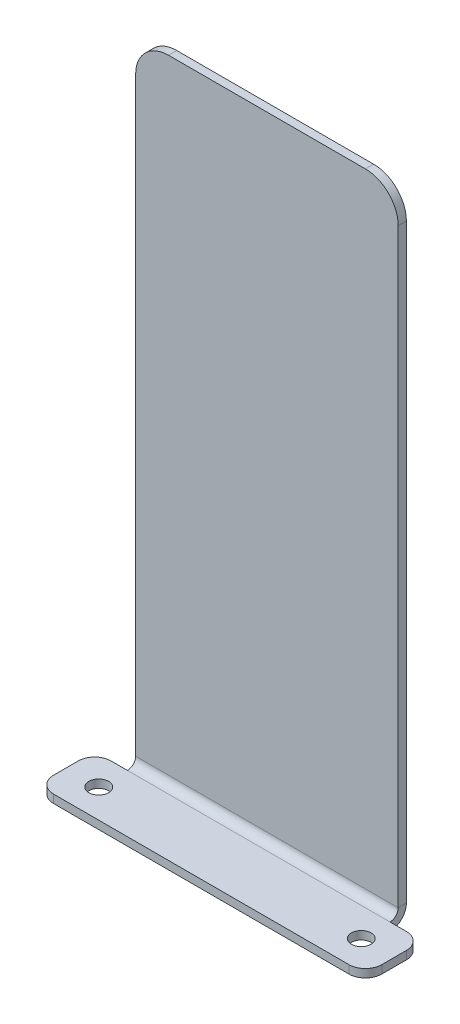
ISO-10303-21;
HEADER;
FILE_DESCRIPTION(('STEP AP214'),'2;1');
FILE_NAME('part.step','',(''),(''),'','','');
FILE_SCHEMA(('AUTOMOTIVE_DESIGN { 1 0 10303 214 1 1 1 1 }'));
ENDSEC;
DATA;
#1=APPLICATION_CONTEXT('core data for automotive mechanical design processes');
#2=APPLICATION_PROTOCOL_DEFINITION('international standard','automotive_design',2000,#1);
#3=PRODUCT_CONTEXT('',#1,'mechanical');
#4=PRODUCT('Part','Part','',(#3));
#5=PRODUCT_RELATED_PRODUCT_CATEGORY('part','',(#4));
#6=PRODUCT_DEFINITION_FORMATION('','',#4);
#7=PRODUCT_DEFINITION_CONTEXT('part definition',#1,'design');
#8=PRODUCT_DEFINITION('design','',#6,#7);
#9=PRODUCT_DEFINITION_SHAPE('','',#8);
#10=(LENGTH_UNIT() NAMED_UNIT(*) SI_UNIT(.MILLI.,.METRE.));
#11=(NAMED_UNIT(*) PLANE_ANGLE_UNIT() SI_UNIT($,.RADIAN.));
#12=(NAMED_UNIT(*) SI_UNIT($,.STERADIAN.) SOLID_ANGLE_UNIT());
#13=UNCERTAINTY_MEASURE_WITH_UNIT(LENGTH_MEASURE(1.E-05),#10,'distance_accuracy_value','');
#14=(GEOMETRIC_REPRESENTATION_CONTEXT(3) GLOBAL_UNCERTAINTY_ASSIGNED_CONTEXT((#13)) GLOBAL_UNIT_ASSIGNED_CONTEXT((#10,
#11,#12)) REPRESENTATION_CONTEXT('',''));
#15=CARTESIAN_POINT('',(0.,0.,0.));
#16=DIRECTION('',(0.,0.,1.));
#17=DIRECTION('',(1.,0.,0.));
#18=AXIS2_PLACEMENT_3D('',#15,#16,#17);
#19=CARTESIAN_POINT('',(50.8,0.,-3.175));
#20=DIRECTION('',(1.,0.,0.));
#21=DIRECTION('',(0.,1.,0.));
#22=AXIS2_PLACEMENT_3D('',#19,#20,#21);
#23=PLANE('',#22);
#24=DIRECTION('',(0.,1.,0.));
#25=VECTOR('',#24,1.);
#26=CARTESIAN_POINT('',(50.8,0.,-3.175));
#27=LINE('',#26,#25);
#28=CARTESIAN_POINT('',(50.8,6.34999999999999,-3.175));
#29=VERTEX_POINT('',#28);
#30=CARTESIAN_POINT('',(50.8,234.95,-3.175));
#31=VERTEX_POINT('',#30);
#32=EDGE_CURVE('E236',#29,#31,#27,.T.);
#33=ORIENTED_EDGE('',*,*,#32,.T.);
#34=DIRECTION('',(0.,0.,1.));
#35=VECTOR('',#34,1.);
#36=CARTESIAN_POINT('',(50.8,234.95,-3.175));
#37=LINE('',#36,#35);
#38=CARTESIAN_POINT('',(50.8,234.95,0.));
#39=VERTEX_POINT('',#38);
#40=EDGE_CURVE('E264',#31,#39,#37,.T.);
#41=ORIENTED_EDGE('',*,*,#40,.T.);
#42=DIRECTION('',(0.,1.,0.));
#43=VECTOR('',#42,1.);
#44=CARTESIAN_POINT('',(50.8,0.,0.));
#45=LINE('',#44,#43);
#46=CARTESIAN_POINT('',(50.8,6.35,0.));
#47=VERTEX_POINT('',#46);
#48=EDGE_CURVE('E245',#47,#39,#45,.T.);
#49=ORIENTED_EDGE('',*,*,#48,.F.);
#50=DIRECTION('',(0.,0.,-1.));
#51=VECTOR('',#50,1.);
#52=CARTESIAN_POINT('',(50.8,6.35,0.));
#53=LINE('',#52,#51);
#54=EDGE_CURVE('E221',#47,#29,#53,.T.);
#55=ORIENTED_EDGE('',*,*,#54,.T.);
#56=EDGE_LOOP('',(#33,#41,#49,#55));
#57=FACE_BOUND('',#56,.T.);
#58=ADVANCED_FACE('F58',(#57),#23,.T.);
#59=CARTESIAN_POINT('',(0.,0.,-3.175));
#60=DIRECTION('',(0.,0.,-1.));
#61=DIRECTION('',(-1.,0.,0.));
#62=AXIS2_PLACEMENT_3D('',#59,#60,#61);
#63=PLANE('',#62);
#64=DIRECTION('',(0.,-1.,0.));
#65=VECTOR('',#64,1.);
#66=CARTESIAN_POINT('',(-50.8,0.,-3.175));
#67=LINE('',#66,#65);
#68=CARTESIAN_POINT('',(-50.8000000000001,234.95,-3.175));
#69=VERTEX_POINT('',#68);
#70=CARTESIAN_POINT('',(-50.8,6.34999999999999,-3.175));
#71=VERTEX_POINT('',#70);
#72=EDGE_CURVE('E234',#69,#71,#67,.T.);
#73=ORIENTED_EDGE('',*,*,#72,.F.);
#74=CARTESIAN_POINT('',(-38.1000000000001,234.95,-3.175));
#75=DIRECTION('',(0.,0.,-1.));
#76=DIRECTION('',(-1.,0.,0.));
#77=AXIS2_PLACEMENT_3D('',#74,#75,#76);
#78=CIRCLE('',#77,12.7);
#79=CARTESIAN_POINT('',(-38.1000000000001,247.65,-3.175));
#80=VERTEX_POINT('',#79);
#81=EDGE_CURVE('E262',#69,#80,#78,.T.);
#82=ORIENTED_EDGE('',*,*,#81,.T.);
#83=DIRECTION('',(-1.,0.,0.));
#84=VECTOR('',#83,1.);
#85=CARTESIAN_POINT('',(-50.8000000000001,247.65,-3.175));
#86=LINE('',#85,#84);
#87=CARTESIAN_POINT('',(38.1,247.65,-3.175));
#88=VERTEX_POINT('',#87);
#89=EDGE_CURVE('E240',#88,#80,#86,.T.);
#90=ORIENTED_EDGE('',*,*,#89,.F.);
#91=CARTESIAN_POINT('',(38.1,234.95,-3.175));
#92=DIRECTION('',(0.,0.,-1.));
#93=DIRECTION('',(-1.,0.,0.));
#94=AXIS2_PLACEMENT_3D('',#91,#92,#93);
#95=CIRCLE('',#94,12.7);
#96=EDGE_CURVE('E260',#88,#31,#95,.T.);
#97=ORIENTED_EDGE('',*,*,#96,.T.);
#98=ORIENTED_EDGE('',*,*,#32,.F.);
#99=DIRECTION('',(1.,0.,0.));
#100=VECTOR('',#99,1.);
#101=CARTESIAN_POINT('',(50.8,6.34999999999999,-3.175));
#102=LINE('',#101,#100);
#103=EDGE_CURVE('E194',#29,#71,#102,.F.);
#104=ORIENTED_EDGE('',*,*,#103,.T.);
#105=EDGE_LOOP('',(#73,#82,#90,#97,#98,#104));
#106=FACE_BOUND('',#105,.T.);
#107=ADVANCED_FACE('F372',(#106),#63,.T.);
#108=CARTESIAN_POINT('',(0.,0.,0.));
#109=DIRECTION('',(0.,0.,-1.));
#110=DIRECTION('',(-1.,0.,0.));
#111=AXIS2_PLACEMENT_3D('',#108,#109,#110);
#112=PLANE('',#111);
#113=DIRECTION('',(-1.,0.,0.));
#114=VECTOR('',#113,1.);
#115=CARTESIAN_POINT('',(-50.8000000000001,247.65,0.));
#116=LINE('',#115,#114);
#117=CARTESIAN_POINT('',(38.1,247.65,0.));
#118=VERTEX_POINT('',#117);
#119=CARTESIAN_POINT('',(-38.1000000000001,247.65,0.));
#120=VERTEX_POINT('',#119);
#121=EDGE_CURVE('E237',#118,#120,#116,.T.);
#122=ORIENTED_EDGE('',*,*,#121,.T.);
#123=CARTESIAN_POINT('',(-38.1000000000001,234.95,0.));
#124=DIRECTION('',(0.,0.,-1.));
#125=DIRECTION('',(-1.,0.,0.));
#126=AXIS2_PLACEMENT_3D('',#123,#124,#125);
#127=CIRCLE('',#126,12.7);
#128=CARTESIAN_POINT('',(-50.8000000000001,234.95,0.));
#129=VERTEX_POINT('',#128);
#130=EDGE_CURVE('E256',#120,#129,#127,.F.);
#131=ORIENTED_EDGE('',*,*,#130,.T.);
#132=DIRECTION('',(0.,-1.,0.));
#133=VECTOR('',#132,1.);
#134=CARTESIAN_POINT('',(-50.8,0.,0.));
#135=LINE('',#134,#133);
#136=CARTESIAN_POINT('',(-50.8,6.34999999999997,0.));
#137=VERTEX_POINT('',#136);
#138=EDGE_CURVE('E232',#129,#137,#135,.T.);
#139=ORIENTED_EDGE('',*,*,#138,.T.);
#140=DIRECTION('',(1.,0.,0.));
#141=VECTOR('',#140,1.);
#142=CARTESIAN_POINT('',(50.8,6.35,0.));
#143=LINE('',#142,#141);
#144=EDGE_CURVE('E225',#47,#137,#143,.F.);
#145=ORIENTED_EDGE('',*,*,#144,.F.);
#146=ORIENTED_EDGE('',*,*,#48,.T.);
#147=CARTESIAN_POINT('',(38.1,234.95,0.));
#148=DIRECTION('',(0.,0.,-1.));
#149=DIRECTION('',(-1.,0.,0.));
#150=AXIS2_PLACEMENT_3D('',#147,#148,#149);
#151=CIRCLE('',#150,12.7);
#152=EDGE_CURVE('E254',#39,#118,#151,.F.);
#153=ORIENTED_EDGE('',*,*,#152,.T.);
#154=EDGE_LOOP('',(#122,#131,#139,#145,#146,#153));
#155=FACE_BOUND('',#154,.T.);
#156=ADVANCED_FACE('F378',(#155),#112,.F.);
#157=CARTESIAN_POINT('',(-50.8,0.,-3.175));
#158=DIRECTION('',(-1.,0.,0.));
#159=DIRECTION('',(0.,-1.,0.));
#160=AXIS2_PLACEMENT_3D('',#157,#158,#159);
#161=PLANE('',#160);
#162=ORIENTED_EDGE('',*,*,#138,.F.);
#163=DIRECTION('',(0.,0.,1.));
#164=VECTOR('',#163,1.);
#165=CARTESIAN_POINT('',(-50.8000000000001,234.95,-3.175));
#166=LINE('',#165,#164);
#167=EDGE_CURVE('E258',#129,#69,#166,.F.);
#168=ORIENTED_EDGE('',*,*,#167,.T.);
#169=ORIENTED_EDGE('',*,*,#72,.T.);
#170=DIRECTION('',(0.,0.,-1.));
#171=VECTOR('',#170,1.);
#172=CARTESIAN_POINT('',(-50.8,6.34999999999997,0.));
#173=LINE('',#172,#171);
#174=EDGE_CURVE('E229',#137,#71,#173,.T.);
#175=ORIENTED_EDGE('',*,*,#174,.F.);
#176=EDGE_LOOP('',(#162,#168,#169,#175));
#177=FACE_BOUND('',#176,.T.);
#178=ADVANCED_FACE('F385',(#177),#161,.T.);
#179=CARTESIAN_POINT('',(-50.8000000000001,247.65,-3.175));
#180=DIRECTION('',(0.,1.,0.));
#181=DIRECTION('',(-1.,0.,0.));
#182=AXIS2_PLACEMENT_3D('',#179,#180,#181);
#183=PLANE('',#182);
#184=ORIENTED_EDGE('',*,*,#89,.T.);
#185=DIRECTION('',(0.,0.,1.));
#186=VECTOR('',#185,1.);
#187=CARTESIAN_POINT('',(-38.1000000000001,247.65,-3.175));
#188=LINE('',#187,#186);
#189=EDGE_CURVE('E251',#80,#120,#188,.T.);
#190=ORIENTED_EDGE('',*,*,#189,.T.);
#191=ORIENTED_EDGE('',*,*,#121,.F.);
#192=DIRECTION('',(0.,0.,1.));
#193=VECTOR('',#192,1.);
#194=CARTESIAN_POINT('',(38.1,247.65,-3.175));
#195=LINE('',#194,#193);
#196=EDGE_CURVE('E243',#118,#88,#195,.F.);
#197=ORIENTED_EDGE('',*,*,#196,.T.);
#198=EDGE_LOOP('',(#184,#190,#191,#197));
#199=FACE_BOUND('',#198,.T.);
#200=ADVANCED_FACE('F383',(#199),#183,.T.);
#201=CARTESIAN_POINT('',(-50.8,6.34999999999997,3.175));
#202=DIRECTION('',(-1.,0.,0.));
#203=DIRECTION('',(0.,-1.,0.));
#204=AXIS2_PLACEMENT_3D('',#201,#202,#203);
#205=PLANE('',#204);
#206=DIRECTION('',(0.,1.,0.));
#207=VECTOR('',#206,1.);
#208=CARTESIAN_POINT('',(-50.8,0.,3.17499999999998));
#209=LINE('',#208,#207);
#210=CARTESIAN_POINT('',(-50.8,3.17499999999998,3.17499999999999));
#211=VERTEX_POINT('',#210);
#212=CARTESIAN_POINT('',(-50.8,0.,3.17499999999998));
#213=VERTEX_POINT('',#212);
#214=EDGE_CURVE('E216',#211,#213,#209,.F.);
#215=ORIENTED_EDGE('',*,*,#214,.F.);
#216=CARTESIAN_POINT('',(-50.8,6.34999999999997,3.175));
#217=DIRECTION('',(1.,0.,0.));
#218=DIRECTION('',(0.,1.,0.));
#219=AXIS2_PLACEMENT_3D('',#216,#217,#218);
#220=CIRCLE('',#219,3.175);
#221=EDGE_CURVE('E197',#137,#211,#220,.F.);
#222=ORIENTED_EDGE('',*,*,#221,.F.);
#223=ORIENTED_EDGE('',*,*,#174,.T.);
#224=CARTESIAN_POINT('',(-50.8,6.34999999999997,3.175));
#225=DIRECTION('',(1.,0.,0.));
#226=DIRECTION('',(0.,1.,0.));
#227=AXIS2_PLACEMENT_3D('',#224,#225,#226);
#228=CIRCLE('',#227,6.35);
#229=EDGE_CURVE('E220',#71,#213,#228,.F.);
#230=ORIENTED_EDGE('',*,*,#229,.T.);
#231=EDGE_LOOP('',(#215,#222,#223,#230));
#232=FACE_BOUND('',#231,.T.);
#233=ADVANCED_FACE('F418',(#232),#205,.T.);
#234=CARTESIAN_POINT('',(50.8,6.35,3.17499999999999));
#235=DIRECTION('',(-1.,0.,0.));
#236=DIRECTION('',(0.,-1.,0.));
#237=AXIS2_PLACEMENT_3D('',#234,#235,#236);
#238=PLANE('',#237);
#239=CARTESIAN_POINT('',(50.8,6.35,3.17499999999999));
#240=DIRECTION('',(1.,0.,0.));
#241=DIRECTION('',(0.,1.,0.));
#242=AXIS2_PLACEMENT_3D('',#239,#240,#241);
#243=CIRCLE('',#242,3.175);
#244=CARTESIAN_POINT('',(50.8,3.175,3.17499999999999));
#245=VERTEX_POINT('',#244);
#246=EDGE_CURVE('E202',#245,#47,#243,.T.);
#247=ORIENTED_EDGE('',*,*,#246,.F.);
#248=DIRECTION('',(0.,1.,0.));
#249=VECTOR('',#248,1.);
#250=CARTESIAN_POINT('',(50.8,3.175,3.17499999999999));
#251=LINE('',#250,#249);
#252=CARTESIAN_POINT('',(50.8,0.,3.17499999999998));
#253=VERTEX_POINT('',#252);
#254=EDGE_CURVE('E177',#245,#253,#251,.F.);
#255=ORIENTED_EDGE('',*,*,#254,.T.);
#256=CARTESIAN_POINT('',(50.8,6.35,3.17499999999999));
#257=DIRECTION('',(1.,0.,0.));
#258=DIRECTION('',(0.,1.,0.));
#259=AXIS2_PLACEMENT_3D('',#256,#257,#258);
#260=CIRCLE('',#259,6.35);
#261=EDGE_CURVE('E188',#253,#29,#260,.T.);
#262=ORIENTED_EDGE('',*,*,#261,.T.);
#263=ORIENTED_EDGE('',*,*,#54,.F.);
#264=EDGE_LOOP('',(#247,#255,#262,#263));
#265=FACE_BOUND('',#264,.T.);
#266=ADVANCED_FACE('F200',(#265),#238,.F.);
#267=CARTESIAN_POINT('',(50.8,6.35,3.17499999999999));
#268=DIRECTION('',(1.,0.,0.));
#269=DIRECTION('',(0.,-1.,0.));
#270=AXIS2_PLACEMENT_3D('',#267,#268,#269);
#271=CYLINDRICAL_SURFACE('',#270,6.35);
#272=ORIENTED_EDGE('',*,*,#103,.F.);
#273=ORIENTED_EDGE('',*,*,#261,.F.);
#274=DIRECTION('',(1.,0.,0.));
#275=VECTOR('',#274,1.);
#276=CARTESIAN_POINT('',(-50.8,0.,3.17499999999998));
#277=LINE('',#276,#275);
#278=EDGE_CURVE('E191',#253,#213,#277,.F.);
#279=ORIENTED_EDGE('',*,*,#278,.T.);
#280=ORIENTED_EDGE('',*,*,#229,.F.);
#281=EDGE_LOOP('',(#272,#273,#279,#280));
#282=FACE_BOUND('',#281,.T.);
#283=ADVANCED_FACE('F189',(#282),#271,.T.);
#284=CARTESIAN_POINT('',(50.8,6.35,3.17499999999999));
#285=DIRECTION('',(1.,0.,0.));
#286=DIRECTION('',(0.,-1.,0.));
#287=AXIS2_PLACEMENT_3D('',#284,#285,#286);
#288=CYLINDRICAL_SURFACE('',#287,3.175);
#289=ORIENTED_EDGE('',*,*,#144,.T.);
#290=ORIENTED_EDGE('',*,*,#221,.T.);
#291=DIRECTION('',(1.,0.,0.));
#292=VECTOR('',#291,1.);
#293=CARTESIAN_POINT('',(-50.8,3.17499999999998,3.17499999999999));
#294=LINE('',#293,#292);
#295=EDGE_CURVE('E203',#211,#245,#294,.T.);
#296=ORIENTED_EDGE('',*,*,#295,.T.);
#297=ORIENTED_EDGE('',*,*,#246,.T.);
#298=EDGE_LOOP('',(#289,#290,#296,#297));
#299=FACE_BOUND('',#298,.T.);
#300=ADVANCED_FACE('F414',(#299),#288,.F.);
#301=CARTESIAN_POINT('',(0.,0.,0.));
#302=DIRECTION('',(0.,1.,0.));
#303=DIRECTION('',(0.,0.,1.));
#304=AXIS2_PLACEMENT_3D('',#301,#302,#303);
#305=PLANE('',#304);
#306=CARTESIAN_POINT('',(-50.8,-2.78423117894278E-13,14.2875));
#307=DIRECTION('',(0.,1.,0.));
#308=DIRECTION('',(0.,0.,1.));
#309=AXIS2_PLACEMENT_3D('',#306,#307,#308);
#310=CIRCLE('',#309,3.81);
#311=CARTESIAN_POINT('',(-50.8,-2.9172566179527E-13,18.0975));
#312=VERTEX_POINT('',#311);
#313=EDGE_CURVE('E343',#312,#312,#310,.T.);
#314=ORIENTED_EDGE('',*,*,#313,.T.);
#315=EDGE_LOOP('',(#314));
#316=FACE_BOUND('',#315,.T.);
#317=CARTESIAN_POINT('',(50.8,-2.59774840527527E-13,14.2875));
#318=DIRECTION('',(0.,1.,0.));
#319=DIRECTION('',(0.,0.,1.));
#320=AXIS2_PLACEMENT_3D('',#317,#318,#319);
#321=CIRCLE('',#320,3.81);
#322=CARTESIAN_POINT('',(50.8,-2.73077384428519E-13,18.0975));
#323=VERTEX_POINT('',#322);
#324=EDGE_CURVE('E315',#323,#323,#321,.T.);
#325=ORIENTED_EDGE('',*,*,#324,.T.);
#326=EDGE_LOOP('',(#325));
#327=FACE_BOUND('',#326,.T.);
#328=DIRECTION('',(0.,0.,-1.));
#329=VECTOR('',#328,1.);
#330=CARTESIAN_POINT('',(-63.5,0.,25.4));
#331=LINE('',#330,#329);
#332=CARTESIAN_POINT('',(-63.5,0.,19.05));
#333=VERTEX_POINT('',#332);
#334=CARTESIAN_POINT('',(-63.5,0.,9.52499999999998));
#335=VERTEX_POINT('',#334);
#336=EDGE_CURVE('E218',#333,#335,#331,.T.);
#337=ORIENTED_EDGE('',*,*,#336,.T.);
#338=CARTESIAN_POINT('',(-57.15,0.,9.52499999999998));
#339=DIRECTION('',(0.,1.,0.));
#340=DIRECTION('',(0.,0.,1.));
#341=AXIS2_PLACEMENT_3D('',#338,#339,#340);
#342=CIRCLE('',#341,6.35);
#343=CARTESIAN_POINT('',(-57.15,0.,3.17499999999998));
#344=VERTEX_POINT('',#343);
#345=EDGE_CURVE('E288',#335,#344,#342,.F.);
#346=ORIENTED_EDGE('',*,*,#345,.T.);
#347=DIRECTION('',(1.,0.,0.));
#348=VECTOR('',#347,1.);
#349=CARTESIAN_POINT('',(-63.5,0.,3.17499999999998));
#350=LINE('',#349,#348);
#351=EDGE_CURVE('E182',#344,#213,#350,.T.);
#352=ORIENTED_EDGE('',*,*,#351,.T.);
#353=ORIENTED_EDGE('',*,*,#278,.F.);
#354=CARTESIAN_POINT('',(57.15,0.,3.17499999999998));
#355=VERTEX_POINT('',#354);
#356=EDGE_CURVE('E172',#253,#355,#350,.T.);
#357=ORIENTED_EDGE('',*,*,#356,.T.);
#358=CARTESIAN_POINT('',(57.15,0.,9.52499999999998));
#359=DIRECTION('',(0.,1.,0.));
#360=DIRECTION('',(0.,0.,1.));
#361=AXIS2_PLACEMENT_3D('',#358,#359,#360);
#362=CIRCLE('',#361,6.35);
#363=CARTESIAN_POINT('',(63.5,0.,9.52499999999998));
#364=VERTEX_POINT('',#363);
#365=EDGE_CURVE('E284',#355,#364,#362,.F.);
#366=ORIENTED_EDGE('',*,*,#365,.T.);
#367=DIRECTION('',(0.,0.,1.));
#368=VECTOR('',#367,1.);
#369=CARTESIAN_POINT('',(63.5,0.,25.4));
#370=LINE('',#369,#368);
#371=CARTESIAN_POINT('',(63.5,0.,19.05));
#372=VERTEX_POINT('',#371);
#373=EDGE_CURVE('E183',#364,#372,#370,.T.);
#374=ORIENTED_EDGE('',*,*,#373,.T.);
#375=CARTESIAN_POINT('',(57.15,0.,19.05));
#376=DIRECTION('',(0.,1.,0.));
#377=DIRECTION('',(0.,0.,1.));
#378=AXIS2_PLACEMENT_3D('',#375,#376,#377);
#379=CIRCLE('',#378,6.35);
#380=CARTESIAN_POINT('',(57.15,0.,25.4));
#381=VERTEX_POINT('',#380);
#382=EDGE_CURVE('E80',#372,#381,#379,.F.);
#383=ORIENTED_EDGE('',*,*,#382,.T.);
#384=DIRECTION('',(-1.,0.,0.));
#385=VECTOR('',#384,1.);
#386=CARTESIAN_POINT('',(0.,0.,25.4));
#387=LINE('',#386,#385);
#388=CARTESIAN_POINT('',(-57.15,0.,25.4));
#389=VERTEX_POINT('',#388);
#390=EDGE_CURVE('E211',#381,#389,#387,.T.);
#391=ORIENTED_EDGE('',*,*,#390,.T.);
#392=CARTESIAN_POINT('',(-57.15,0.,19.05));
#393=DIRECTION('',(0.,1.,0.));
#394=DIRECTION('',(0.,0.,1.));
#395=AXIS2_PLACEMENT_3D('',#392,#393,#394);
#396=CIRCLE('',#395,6.35);
#397=EDGE_CURVE('E286',#389,#333,#396,.F.);
#398=ORIENTED_EDGE('',*,*,#397,.T.);
#399=EDGE_LOOP('',(#337,#346,#352,#353,#357,#366,#374,#383,#391,#398));
#400=FACE_BOUND('',#399,.T.);
#401=ADVANCED_FACE('F206',(#316,#327,#400),#305,.F.);
#402=CARTESIAN_POINT('',(0.,3.175,0.));
#403=DIRECTION('',(0.,1.,0.));
#404=DIRECTION('',(0.,0.,1.));
#405=AXIS2_PLACEMENT_3D('',#402,#403,#404);
#406=PLANE('',#405);
#407=CARTESIAN_POINT('',(-50.8,3.17499999999994,14.2875));
#408=DIRECTION('',(0.,1.,0.));
#409=DIRECTION('',(0.,0.,1.));
#410=AXIS2_PLACEMENT_3D('',#407,#408,#409);
#411=CIRCLE('',#410,3.81);
#412=CARTESIAN_POINT('',(-50.8,3.17499999999993,18.0975));
#413=VERTEX_POINT('',#412);
#414=EDGE_CURVE('E346',#413,#413,#411,.T.);
#415=ORIENTED_EDGE('',*,*,#414,.F.);
#416=EDGE_LOOP('',(#415));
#417=FACE_BOUND('',#416,.T.);
#418=CARTESIAN_POINT('',(50.8,3.17499999999996,14.2875));
#419=DIRECTION('',(0.,1.,0.));
#420=DIRECTION('',(0.,0.,1.));
#421=AXIS2_PLACEMENT_3D('',#418,#419,#420);
#422=CIRCLE('',#421,3.81);
#423=CARTESIAN_POINT('',(50.8,3.17499999999995,18.0975));
#424=VERTEX_POINT('',#423);
#425=EDGE_CURVE('E340',#424,#424,#422,.T.);
#426=ORIENTED_EDGE('',*,*,#425,.F.);
#427=EDGE_LOOP('',(#426));
#428=FACE_BOUND('',#427,.T.);
#429=DIRECTION('',(-1.,0.,0.));
#430=VECTOR('',#429,1.);
#431=CARTESIAN_POINT('',(-63.5,3.17499999999998,3.17499999999999));
#432=LINE('',#431,#430);
#433=CARTESIAN_POINT('',(-57.15,3.17499999999998,3.17499999999999));
#434=VERTEX_POINT('',#433);
#435=EDGE_CURVE('E309',#211,#434,#432,.T.);
#436=ORIENTED_EDGE('',*,*,#435,.T.);
#437=CARTESIAN_POINT('',(-57.15,3.17499999999998,9.52499999999999));
#438=DIRECTION('',(0.,1.,0.));
#439=DIRECTION('',(0.,0.,1.));
#440=AXIS2_PLACEMENT_3D('',#437,#438,#439);
#441=CIRCLE('',#440,6.35);
#442=CARTESIAN_POINT('',(-63.5,3.17499999999996,9.525));
#443=VERTEX_POINT('',#442);
#444=EDGE_CURVE('E276',#434,#443,#441,.T.);
#445=ORIENTED_EDGE('',*,*,#444,.T.);
#446=DIRECTION('',(0.,0.,1.));
#447=VECTOR('',#446,1.);
#448=CARTESIAN_POINT('',(-63.5,3.1749999999999,25.4));
#449=LINE('',#448,#447);
#450=CARTESIAN_POINT('',(-63.5,3.17499999999992,19.05));
#451=VERTEX_POINT('',#450);
#452=EDGE_CURVE('E310',#443,#451,#449,.T.);
#453=ORIENTED_EDGE('',*,*,#452,.T.);
#454=CARTESIAN_POINT('',(-57.15,3.17499999999996,19.05));
#455=DIRECTION('',(0.,1.,0.));
#456=DIRECTION('',(0.,0.,1.));
#457=AXIS2_PLACEMENT_3D('',#454,#455,#456);
#458=CIRCLE('',#457,6.35);
#459=CARTESIAN_POINT('',(-57.15,3.1749999999999,25.4));
#460=VERTEX_POINT('',#459);
#461=EDGE_CURVE('E274',#451,#460,#458,.T.);
#462=ORIENTED_EDGE('',*,*,#461,.T.);
#463=DIRECTION('',(1.,0.,0.));
#464=VECTOR('',#463,1.);
#465=CARTESIAN_POINT('',(-50.8,3.1749999999999,25.4));
#466=LINE('',#465,#464);
#467=CARTESIAN_POINT('',(57.15,3.17499999999992,25.4));
#468=VERTEX_POINT('',#467);
#469=EDGE_CURVE('E209',#468,#460,#466,.F.);
#470=ORIENTED_EDGE('',*,*,#469,.F.);
#471=CARTESIAN_POINT('',(57.15,3.17499999999994,19.05));
#472=DIRECTION('',(0.,1.,0.));
#473=DIRECTION('',(0.,0.,1.));
#474=AXIS2_PLACEMENT_3D('',#471,#472,#473);
#475=CIRCLE('',#474,6.35);
#476=CARTESIAN_POINT('',(63.5,3.17499999999994,19.05));
#477=VERTEX_POINT('',#476);
#478=EDGE_CURVE('E270',#468,#477,#475,.T.);
#479=ORIENTED_EDGE('',*,*,#478,.T.);
#480=DIRECTION('',(0.,0.,-1.));
#481=VECTOR('',#480,1.);
#482=CARTESIAN_POINT('',(63.5,3.17499999999992,25.4));
#483=LINE('',#482,#481);
#484=CARTESIAN_POINT('',(63.5,3.17499999999998,9.525));
#485=VERTEX_POINT('',#484);
#486=EDGE_CURVE('E302',#477,#485,#483,.T.);
#487=ORIENTED_EDGE('',*,*,#486,.T.);
#488=CARTESIAN_POINT('',(57.15,3.17499999999998,9.52499999999999));
#489=DIRECTION('',(0.,1.,0.));
#490=DIRECTION('',(0.,0.,1.));
#491=AXIS2_PLACEMENT_3D('',#488,#489,#490);
#492=CIRCLE('',#491,6.35);
#493=CARTESIAN_POINT('',(57.15,3.175,3.17499999999999));
#494=VERTEX_POINT('',#493);
#495=EDGE_CURVE('E272',#485,#494,#492,.T.);
#496=ORIENTED_EDGE('',*,*,#495,.T.);
#497=EDGE_CURVE('E312',#494,#245,#432,.T.);
#498=ORIENTED_EDGE('',*,*,#497,.T.);
#499=ORIENTED_EDGE('',*,*,#295,.F.);
#500=EDGE_LOOP('',(#436,#445,#453,#462,#470,#479,#487,#496,#498,#499));
#501=FACE_BOUND('',#500,.T.);
#502=ADVANCED_FACE('F307',(#417,#428,#501),#406,.T.);
#503=CARTESIAN_POINT('',(-50.8,0.,25.4));
#504=DIRECTION('',(0.,0.,-1.));
#505=DIRECTION('',(0.,1.,0.));
#506=AXIS2_PLACEMENT_3D('',#503,#504,#505);
#507=PLANE('',#506);
#508=ORIENTED_EDGE('',*,*,#469,.T.);
#509=DIRECTION('',(0.,1.,0.));
#510=VECTOR('',#509,1.);
#511=CARTESIAN_POINT('',(-57.15,0.,25.4));
#512=LINE('',#511,#510);
#513=EDGE_CURVE('E73',#460,#389,#512,.F.);
#514=ORIENTED_EDGE('',*,*,#513,.T.);
#515=ORIENTED_EDGE('',*,*,#390,.F.);
#516=DIRECTION('',(0.,1.,0.));
#517=VECTOR('',#516,1.);
#518=CARTESIAN_POINT('',(57.15,3.17499999999992,25.4));
#519=LINE('',#518,#517);
#520=EDGE_CURVE('E290',#381,#468,#519,.T.);
#521=ORIENTED_EDGE('',*,*,#520,.T.);
#522=EDGE_LOOP('',(#508,#514,#515,#521));
#523=FACE_BOUND('',#522,.T.);
#524=ADVANCED_FACE('F354',(#523),#507,.F.);
#525=CARTESIAN_POINT('',(-38.1000000000001,234.95,-3.175));
#526=DIRECTION('',(0.,0.,1.));
#527=DIRECTION('',(1.,0.,0.));
#528=AXIS2_PLACEMENT_3D('',#525,#526,#527);
#529=CYLINDRICAL_SURFACE('',#528,12.7);
#530=ORIENTED_EDGE('',*,*,#81,.F.);
#531=ORIENTED_EDGE('',*,*,#167,.F.);
#532=ORIENTED_EDGE('',*,*,#130,.F.);
#533=ORIENTED_EDGE('',*,*,#189,.F.);
#534=EDGE_LOOP('',(#530,#531,#532,#533));
#535=FACE_BOUND('',#534,.T.);
#536=ADVANCED_FACE('F389',(#535),#529,.T.);
#537=CARTESIAN_POINT('',(38.1,234.95,-3.175));
#538=DIRECTION('',(0.,0.,1.));
#539=DIRECTION('',(1.,0.,0.));
#540=AXIS2_PLACEMENT_3D('',#537,#538,#539);
#541=CYLINDRICAL_SURFACE('',#540,12.7);
#542=ORIENTED_EDGE('',*,*,#96,.F.);
#543=ORIENTED_EDGE('',*,*,#196,.F.);
#544=ORIENTED_EDGE('',*,*,#152,.F.);
#545=ORIENTED_EDGE('',*,*,#40,.F.);
#546=EDGE_LOOP('',(#542,#543,#544,#545));
#547=FACE_BOUND('',#546,.T.);
#548=ADVANCED_FACE('F392',(#547),#541,.T.);
#549=CARTESIAN_POINT('',(63.5,-128.930022201968,25.3999999999995));
#550=DIRECTION('',(1.,0.,0.));
#551=DIRECTION('',(0.,1.,0.));
#552=AXIS2_PLACEMENT_3D('',#549,#550,#551);
#553=PLANE('',#552);
#554=ORIENTED_EDGE('',*,*,#373,.F.);
#555=DIRECTION('',(0.,1.,0.));
#556=VECTOR('',#555,1.);
#557=CARTESIAN_POINT('',(63.5,-128.930022201968,9.52499999999953));
#558=LINE('',#557,#556);
#559=EDGE_CURVE('E66',#364,#485,#558,.T.);
#560=ORIENTED_EDGE('',*,*,#559,.T.);
#561=ORIENTED_EDGE('',*,*,#486,.F.);
#562=DIRECTION('',(0.,1.,0.));
#563=VECTOR('',#562,1.);
#564=CARTESIAN_POINT('',(63.5,0.,19.05));
#565=LINE('',#564,#563);
#566=EDGE_CURVE('E294',#477,#372,#565,.F.);
#567=ORIENTED_EDGE('',*,*,#566,.T.);
#568=EDGE_LOOP('',(#554,#560,#561,#567));
#569=FACE_BOUND('',#568,.T.);
#570=ADVANCED_FACE('F301',(#569),#553,.T.);
#571=CARTESIAN_POINT('',(-63.5,-128.930022201968,3.17499999999953));
#572=DIRECTION('',(0.,0.,-1.));
#573=DIRECTION('',(0.,1.,0.));
#574=AXIS2_PLACEMENT_3D('',#571,#572,#573);
#575=PLANE('',#574);
#576=ORIENTED_EDGE('',*,*,#497,.F.);
#577=DIRECTION('',(0.,1.,0.));
#578=VECTOR('',#577,1.);
#579=CARTESIAN_POINT('',(57.15,-128.930022201968,3.17499999999953));
#580=LINE('',#579,#578);
#581=EDGE_CURVE('E13',#494,#355,#580,.F.);
#582=ORIENTED_EDGE('',*,*,#581,.T.);
#583=ORIENTED_EDGE('',*,*,#356,.F.);
#584=ORIENTED_EDGE('',*,*,#254,.F.);
#585=EDGE_LOOP('',(#576,#582,#583,#584));
#586=FACE_BOUND('',#585,.T.);
#587=ADVANCED_FACE('F175',(#586),#575,.T.);
#588=ORIENTED_EDGE('',*,*,#351,.F.);
#589=DIRECTION('',(0.,1.,0.));
#590=VECTOR('',#589,1.);
#591=CARTESIAN_POINT('',(-57.15,-128.930022201968,3.17499999999953));
#592=LINE('',#591,#590);
#593=EDGE_CURVE('E267',#344,#434,#592,.T.);
#594=ORIENTED_EDGE('',*,*,#593,.T.);
#595=ORIENTED_EDGE('',*,*,#435,.F.);
#596=ORIENTED_EDGE('',*,*,#214,.T.);
#597=EDGE_LOOP('',(#588,#594,#595,#596));
#598=FACE_BOUND('',#597,.T.);
#599=ADVANCED_FACE('F334',(#598),#575,.T.);
#600=CARTESIAN_POINT('',(-63.5,-128.930022201968,25.3999999999995));
#601=DIRECTION('',(-1.,0.,0.));
#602=DIRECTION('',(0.,-1.,0.));
#603=AXIS2_PLACEMENT_3D('',#600,#601,#602);
#604=PLANE('',#603);
#605=ORIENTED_EDGE('',*,*,#452,.F.);
#606=DIRECTION('',(0.,1.,0.));
#607=VECTOR('',#606,1.);
#608=CARTESIAN_POINT('',(-63.5,-128.930022201968,9.52499999999953));
#609=LINE('',#608,#607);
#610=EDGE_CURVE('E281',#443,#335,#609,.F.);
#611=ORIENTED_EDGE('',*,*,#610,.T.);
#612=ORIENTED_EDGE('',*,*,#336,.F.);
#613=DIRECTION('',(0.,1.,0.));
#614=VECTOR('',#613,1.);
#615=CARTESIAN_POINT('',(-63.5,3.17499999999993,19.05));
#616=LINE('',#615,#614);
#617=EDGE_CURVE('E278',#333,#451,#616,.T.);
#618=ORIENTED_EDGE('',*,*,#617,.T.);
#619=EDGE_LOOP('',(#605,#611,#612,#618));
#620=FACE_BOUND('',#619,.T.);
#621=ADVANCED_FACE('F326',(#620),#604,.T.);
#622=CARTESIAN_POINT('',(50.8,3.17499999999996,14.2875));
#623=DIRECTION('',(0.,1.,0.));
#624=DIRECTION('',(0.,0.,1.));
#625=AXIS2_PLACEMENT_3D('',#622,#623,#624);
#626=CYLINDRICAL_SURFACE('',#625,3.81);
#627=ORIENTED_EDGE('',*,*,#324,.F.);
#628=EDGE_LOOP('',(#627));
#629=FACE_BOUND('',#628,.T.);
#630=ORIENTED_EDGE('',*,*,#425,.T.);
#631=EDGE_LOOP('',(#630));
#632=FACE_BOUND('',#631,.T.);
#633=ADVANCED_FACE('F358',(#629,#632),#626,.F.);
#634=CARTESIAN_POINT('',(-50.8,3.17499999999994,14.2875));
#635=DIRECTION('',(0.,1.,0.));
#636=DIRECTION('',(0.,0.,1.));
#637=AXIS2_PLACEMENT_3D('',#634,#635,#636);
#638=CYLINDRICAL_SURFACE('',#637,3.81);
#639=ORIENTED_EDGE('',*,*,#313,.F.);
#640=EDGE_LOOP('',(#639));
#641=FACE_BOUND('',#640,.T.);
#642=ORIENTED_EDGE('',*,*,#414,.T.);
#643=EDGE_LOOP('',(#642));
#644=FACE_BOUND('',#643,.T.);
#645=ADVANCED_FACE('F350',(#641,#644),#638,.F.);
#646=CARTESIAN_POINT('',(-57.15,-128.930022201968,9.52499999999953));
#647=DIRECTION('',(0.,1.,0.));
#648=DIRECTION('',(0.,0.,1.));
#649=AXIS2_PLACEMENT_3D('',#646,#647,#648);
#650=CYLINDRICAL_SURFACE('',#649,6.35);
#651=ORIENTED_EDGE('',*,*,#345,.F.);
#652=ORIENTED_EDGE('',*,*,#610,.F.);
#653=ORIENTED_EDGE('',*,*,#444,.F.);
#654=ORIENTED_EDGE('',*,*,#593,.F.);
#655=EDGE_LOOP('',(#651,#652,#653,#654));
#656=FACE_BOUND('',#655,.T.);
#657=ADVANCED_FACE('F332',(#656),#650,.T.);
#658=CARTESIAN_POINT('',(-57.15,-128.930022201968,19.0499999999995));
#659=DIRECTION('',(0.,-1.,0.));
#660=DIRECTION('',(0.,0.,-1.));
#661=AXIS2_PLACEMENT_3D('',#658,#659,#660);
#662=CYLINDRICAL_SURFACE('',#661,6.35);
#663=ORIENTED_EDGE('',*,*,#397,.F.);
#664=ORIENTED_EDGE('',*,*,#513,.F.);
#665=ORIENTED_EDGE('',*,*,#461,.F.);
#666=ORIENTED_EDGE('',*,*,#617,.F.);
#667=EDGE_LOOP('',(#663,#664,#665,#666));
#668=FACE_BOUND('',#667,.T.);
#669=ADVANCED_FACE('F323',(#668),#662,.T.);
#670=CARTESIAN_POINT('',(57.15,-128.930022201968,9.52499999999953));
#671=DIRECTION('',(0.,1.,0.));
#672=DIRECTION('',(0.,0.,1.));
#673=AXIS2_PLACEMENT_3D('',#670,#671,#672);
#674=CYLINDRICAL_SURFACE('',#673,6.35);
#675=ORIENTED_EDGE('',*,*,#365,.F.);
#676=ORIENTED_EDGE('',*,*,#581,.F.);
#677=ORIENTED_EDGE('',*,*,#495,.F.);
#678=ORIENTED_EDGE('',*,*,#559,.F.);
#679=EDGE_LOOP('',(#675,#676,#677,#678));
#680=FACE_BOUND('',#679,.T.);
#681=ADVANCED_FACE('F400',(#680),#674,.T.);
#682=CARTESIAN_POINT('',(57.15,0.,19.05));
#683=DIRECTION('',(0.,-1.,0.));
#684=DIRECTION('',(0.,0.,-1.));
#685=AXIS2_PLACEMENT_3D('',#682,#683,#684);
#686=CYLINDRICAL_SURFACE('',#685,6.35);
#687=ORIENTED_EDGE('',*,*,#382,.F.);
#688=ORIENTED_EDGE('',*,*,#566,.F.);
#689=ORIENTED_EDGE('',*,*,#478,.F.);
#690=ORIENTED_EDGE('',*,*,#520,.F.);
#691=EDGE_LOOP('',(#687,#688,#689,#690));
#692=FACE_BOUND('',#691,.T.);
#693=ADVANCED_FACE('F60',(#692),#686,.T.);
#694=CLOSED_SHELL('',(#58,#107,#156,#178,#200,#233,#266,#283,#300,#401,#502,#524,#536,#548,#570,
#587,#599,#621,#633,#645,#657,#669,#681,#693));
#695=MANIFOLD_SOLID_BREP('B2',#694);
#696=ADVANCED_BREP_SHAPE_REPRESENTATION('',(#18,#695),#14);
#697=SHAPE_DEFINITION_REPRESENTATION(#9,#696);
ENDSEC;
END-ISO-10303-21;
